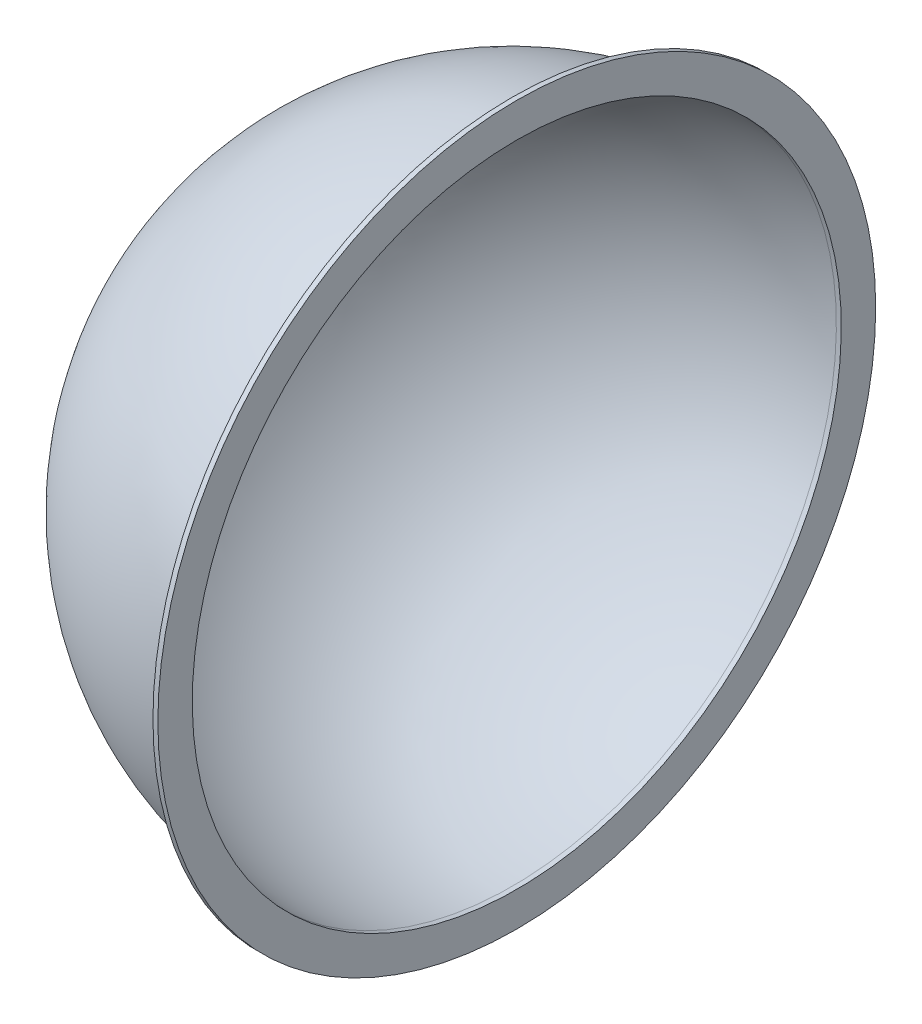
ISO-10303-21;
HEADER;
FILE_DESCRIPTION(('STEP AP214'),'2;1');
FILE_NAME('part.step','',(''),(''),'','','');
FILE_SCHEMA(('AUTOMOTIVE_DESIGN { 1 0 10303 214 1 1 1 1 }'));
ENDSEC;
DATA;
#1=APPLICATION_CONTEXT('core data for automotive mechanical design processes');
#2=APPLICATION_PROTOCOL_DEFINITION('international standard','automotive_design',2000,#1);
#3=PRODUCT_CONTEXT('',#1,'mechanical');
#4=PRODUCT('Part','Part','',(#3));
#5=PRODUCT_RELATED_PRODUCT_CATEGORY('part','',(#4));
#6=PRODUCT_DEFINITION_FORMATION('','',#4);
#7=PRODUCT_DEFINITION_CONTEXT('part definition',#1,'design');
#8=PRODUCT_DEFINITION('design','',#6,#7);
#9=PRODUCT_DEFINITION_SHAPE('','',#8);
#10=(LENGTH_UNIT() NAMED_UNIT(*) SI_UNIT(.MILLI.,.METRE.));
#11=(NAMED_UNIT(*) PLANE_ANGLE_UNIT() SI_UNIT($,.RADIAN.));
#12=(NAMED_UNIT(*) SI_UNIT($,.STERADIAN.) SOLID_ANGLE_UNIT());
#13=UNCERTAINTY_MEASURE_WITH_UNIT(LENGTH_MEASURE(1.E-05),#10,'distance_accuracy_value','');
#14=(GEOMETRIC_REPRESENTATION_CONTEXT(3) GLOBAL_UNCERTAINTY_ASSIGNED_CONTEXT((#13)) GLOBAL_UNIT_ASSIGNED_CONTEXT((#10,
#11,#12)) REPRESENTATION_CONTEXT('',''));
#15=CARTESIAN_POINT('',(0.,0.,0.));
#16=DIRECTION('',(0.,0.,1.));
#17=DIRECTION('',(1.,0.,0.));
#18=AXIS2_PLACEMENT_3D('',#15,#16,#17);
#19=CARTESIAN_POINT('',(-22.225,33.3375,0.));
#20=DIRECTION('',(1.,0.,0.));
#21=DIRECTION('',(0.,1.,0.));
#22=AXIS2_PLACEMENT_3D('',#19,#20,#21);
#23=CYLINDRICAL_SURFACE('',#22,104.775);
#24=CARTESIAN_POINT('',(-22.225,33.3375,0.));
#25=DIRECTION('',(1.,0.,0.));
#26=DIRECTION('',(0.,1.,0.));
#27=AXIS2_PLACEMENT_3D('',#24,#25,#26);
#28=CIRCLE('',#27,104.775);
#29=CARTESIAN_POINT('',(-22.225,138.1125,0.));
#30=VERTEX_POINT('',#29);
#31=EDGE_CURVE('E10',#30,#30,#28,.T.);
#32=ORIENTED_EDGE('',*,*,#31,.T.);
#33=EDGE_LOOP('',(#32));
#34=FACE_BOUND('',#33,.T.);
#35=CARTESIAN_POINT('',(-23.8124999999999,33.3375,0.));
#36=DIRECTION('',(1.,0.,0.));
#37=DIRECTION('',(0.,1.,0.));
#38=AXIS2_PLACEMENT_3D('',#35,#36,#37);
#39=CIRCLE('',#38,104.775);
#40=CARTESIAN_POINT('',(-23.8125,138.1125,0.));
#41=VERTEX_POINT('',#40);
#42=EDGE_CURVE('E48',#41,#41,#39,.T.);
#43=ORIENTED_EDGE('',*,*,#42,.F.);
#44=EDGE_LOOP('',(#43));
#45=FACE_BOUND('',#44,.T.);
#46=ADVANCED_FACE('F29',(#34,#45),#23,.F.);
#47=CARTESIAN_POINT('',(-22.225,138.1125,0.));
#48=DIRECTION('',(1.,0.,0.));
#49=DIRECTION('',(0.,1.,0.));
#50=AXIS2_PLACEMENT_3D('',#47,#48,#49);
#51=PLANE('',#50);
#52=CARTESIAN_POINT('',(-22.225,33.3375,0.));
#53=DIRECTION('',(1.,0.,0.));
#54=DIRECTION('',(0.,1.,0.));
#55=AXIS2_PLACEMENT_3D('',#52,#53,#54);
#56=CIRCLE('',#55,115.8875);
#57=CARTESIAN_POINT('',(-22.225,149.225,0.));
#58=VERTEX_POINT('',#57);
#59=EDGE_CURVE('E35',#58,#58,#56,.T.);
#60=ORIENTED_EDGE('',*,*,#59,.T.);
#61=EDGE_LOOP('',(#60));
#62=FACE_BOUND('',#61,.T.);
#63=ORIENTED_EDGE('',*,*,#31,.F.);
#64=EDGE_LOOP('',(#63));
#65=FACE_BOUND('',#64,.T.);
#66=ADVANCED_FACE('F55',(#62,#65),#51,.T.);
#67=CARTESIAN_POINT('',(-22.225,33.3375,0.));
#68=DIRECTION('',(1.,0.,0.));
#69=DIRECTION('',(0.,1.,0.));
#70=AXIS2_PLACEMENT_3D('',#67,#68,#69);
#71=CYLINDRICAL_SURFACE('',#70,115.8875);
#72=CARTESIAN_POINT('',(-23.8125,33.3375,0.));
#73=DIRECTION('',(1.,0.,0.));
#74=DIRECTION('',(0.,1.,0.));
#75=AXIS2_PLACEMENT_3D('',#72,#73,#74);
#76=CIRCLE('',#75,115.8875);
#77=CARTESIAN_POINT('',(-23.8125,149.225,0.));
#78=VERTEX_POINT('',#77);
#79=EDGE_CURVE('E39',#78,#78,#76,.T.);
#80=ORIENTED_EDGE('',*,*,#79,.T.);
#81=EDGE_LOOP('',(#80));
#82=FACE_BOUND('',#81,.T.);
#83=ORIENTED_EDGE('',*,*,#59,.F.);
#84=EDGE_LOOP('',(#83));
#85=FACE_BOUND('',#84,.T.);
#86=ADVANCED_FACE('F59',(#82,#85),#71,.T.);
#87=CARTESIAN_POINT('',(-23.8125,149.225,0.));
#88=DIRECTION('',(-1.,0.,0.));
#89=DIRECTION('',(0.,-1.,0.));
#90=AXIS2_PLACEMENT_3D('',#87,#88,#89);
#91=PLANE('',#90);
#92=CARTESIAN_POINT('',(-23.8125,33.3375,0.));
#93=DIRECTION('',(1.,0.,0.));
#94=DIRECTION('',(0.,1.,0.));
#95=AXIS2_PLACEMENT_3D('',#92,#93,#94);
#96=CIRCLE('',#95,106.3625);
#97=CARTESIAN_POINT('',(-23.8125,139.7,0.));
#98=VERTEX_POINT('',#97);
#99=EDGE_CURVE('E43',#98,#98,#96,.T.);
#100=ORIENTED_EDGE('',*,*,#99,.T.);
#101=EDGE_LOOP('',(#100));
#102=FACE_BOUND('',#101,.T.);
#103=ORIENTED_EDGE('',*,*,#79,.F.);
#104=EDGE_LOOP('',(#103));
#105=FACE_BOUND('',#104,.T.);
#106=ADVANCED_FACE('F63',(#102,#105),#91,.T.);
#107=CARTESIAN_POINT('',(-23.8125,33.3375,0.));
#108=DIRECTION('',(1.,0.,0.));
#109=DIRECTION('',(0.,1.,0.));
#110=AXIS2_PLACEMENT_3D('',#107,#108,#109);
#111=SPHERICAL_SURFACE('',#110,106.3625);
#112=ORIENTED_EDGE('',*,*,#99,.F.);
#113=EDGE_LOOP('',(#112));
#114=FACE_BOUND('',#113,.T.);
#115=ADVANCED_FACE('F70',(#114),#111,.T.);
#116=CARTESIAN_POINT('',(-23.8125,33.3375,0.));
#117=DIRECTION('',(1.,0.,0.));
#118=DIRECTION('',(0.,1.,0.));
#119=AXIS2_PLACEMENT_3D('',#116,#117,#118);
#120=SPHERICAL_SURFACE('',#119,104.775);
#121=ORIENTED_EDGE('',*,*,#42,.T.);
#122=EDGE_LOOP('',(#121));
#123=FACE_BOUND('',#122,.T.);
#124=ADVANCED_FACE('F52',(#123),#120,.F.);
#125=CLOSED_SHELL('',(#46,#66,#86,#106,#115,#124));
#126=MANIFOLD_SOLID_BREP('B2',#125);
#127=ADVANCED_BREP_SHAPE_REPRESENTATION('',(#18,#126),#14);
#128=SHAPE_DEFINITION_REPRESENTATION(#9,#127);
ENDSEC;
END-ISO-10303-21;
